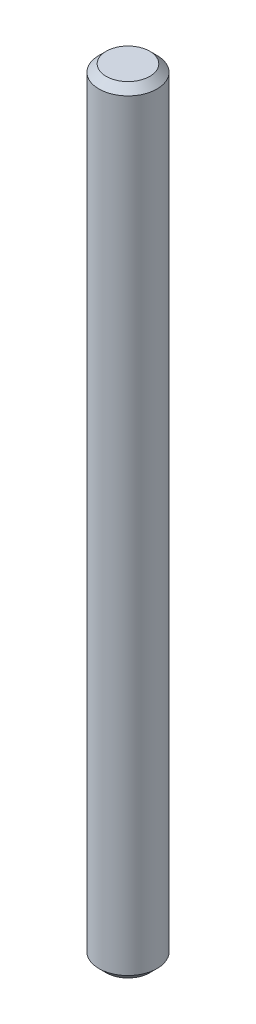
ISO-10303-21;
HEADER;
FILE_DESCRIPTION(('STEP AP214'),'2;1');
FILE_NAME('part.step','',(''),(''),'','','');
FILE_SCHEMA(('AUTOMOTIVE_DESIGN { 1 0 10303 214 1 1 1 1 }'));
ENDSEC;
DATA;
#1=APPLICATION_CONTEXT('core data for automotive mechanical design processes');
#2=APPLICATION_PROTOCOL_DEFINITION('international standard','automotive_design',2000,#1);
#3=PRODUCT_CONTEXT('',#1,'mechanical');
#4=PRODUCT('Part','Part','',(#3));
#5=PRODUCT_RELATED_PRODUCT_CATEGORY('part','',(#4));
#6=PRODUCT_DEFINITION_FORMATION('','',#4);
#7=PRODUCT_DEFINITION_CONTEXT('part definition',#1,'design');
#8=PRODUCT_DEFINITION('design','',#6,#7);
#9=PRODUCT_DEFINITION_SHAPE('','',#8);
#10=(LENGTH_UNIT() NAMED_UNIT(*) SI_UNIT(.MILLI.,.METRE.));
#11=(NAMED_UNIT(*) PLANE_ANGLE_UNIT() SI_UNIT($,.RADIAN.));
#12=(NAMED_UNIT(*) SI_UNIT($,.STERADIAN.) SOLID_ANGLE_UNIT());
#13=UNCERTAINTY_MEASURE_WITH_UNIT(LENGTH_MEASURE(1.E-05),#10,'distance_accuracy_value','');
#14=(GEOMETRIC_REPRESENTATION_CONTEXT(3) GLOBAL_UNCERTAINTY_ASSIGNED_CONTEXT((#13)) GLOBAL_UNIT_ASSIGNED_CONTEXT((#10,
#11,#12)) REPRESENTATION_CONTEXT('',''));
#15=CARTESIAN_POINT('',(0.,0.,0.));
#16=DIRECTION('',(0.,0.,1.));
#17=DIRECTION('',(1.,0.,0.));
#18=AXIS2_PLACEMENT_3D('',#15,#16,#17);
#19=CARTESIAN_POINT('',(0.,26.7,0.));
#20=DIRECTION('',(0.,-1.,0.));
#21=DIRECTION('',(0.,0.,-1.));
#22=AXIS2_PLACEMENT_3D('',#19,#20,#21);
#23=PLANE('',#22);
#24=CARTESIAN_POINT('',(0.,26.7,0.));
#25=DIRECTION('',(0.,1.,0.));
#26=DIRECTION('',(0.,0.,1.));
#27=AXIS2_PLACEMENT_3D('',#24,#25,#26);
#28=CIRCLE('',#27,1.5);
#29=CARTESIAN_POINT('',(0.,26.7,1.5));
#30=VERTEX_POINT('',#29);
#31=EDGE_CURVE('E10',#30,#30,#28,.T.);
#32=ORIENTED_EDGE('',*,*,#31,.T.);
#33=EDGE_LOOP('',(#32));
#34=FACE_BOUND('',#33,.T.);
#35=ADVANCED_FACE('F30',(#34),#23,.F.);
#36=CARTESIAN_POINT('',(0.,26.2,0.));
#37=DIRECTION('',(0.,-1.,0.));
#38=DIRECTION('',(0.,0.,-1.));
#39=AXIS2_PLACEMENT_3D('',#36,#37,#38);
#40=CONICAL_SURFACE('',#39,2.,0.785398163397448);
#41=ORIENTED_EDGE('',*,*,#31,.F.);
#42=EDGE_LOOP('',(#41));
#43=FACE_BOUND('',#42,.T.);
#44=CARTESIAN_POINT('',(0.,26.2,0.));
#45=DIRECTION('',(0.,1.,0.));
#46=DIRECTION('',(0.,0.,1.));
#47=AXIS2_PLACEMENT_3D('',#44,#45,#46);
#48=CIRCLE('',#47,2.);
#49=CARTESIAN_POINT('',(0.,26.2,2.));
#50=VERTEX_POINT('',#49);
#51=EDGE_CURVE('E36',#50,#50,#48,.T.);
#52=ORIENTED_EDGE('',*,*,#51,.T.);
#53=EDGE_LOOP('',(#52));
#54=FACE_BOUND('',#53,.T.);
#55=ADVANCED_FACE('F62',(#43,#54),#40,.T.);
#56=CARTESIAN_POINT('',(0.,-26.7,0.));
#57=DIRECTION('',(0.,1.,0.));
#58=DIRECTION('',(0.,0.,1.));
#59=AXIS2_PLACEMENT_3D('',#56,#57,#58);
#60=CYLINDRICAL_SURFACE('',#59,2.);
#61=ORIENTED_EDGE('',*,*,#51,.F.);
#62=EDGE_LOOP('',(#61));
#63=FACE_BOUND('',#62,.T.);
#64=CARTESIAN_POINT('',(0.,-26.2,0.));
#65=DIRECTION('',(0.,1.,0.));
#66=DIRECTION('',(0.,0.,1.));
#67=AXIS2_PLACEMENT_3D('',#64,#65,#66);
#68=CIRCLE('',#67,2.);
#69=CARTESIAN_POINT('',(0.,-26.2,2.));
#70=VERTEX_POINT('',#69);
#71=EDGE_CURVE('E40',#70,#70,#68,.T.);
#72=ORIENTED_EDGE('',*,*,#71,.T.);
#73=EDGE_LOOP('',(#72));
#74=FACE_BOUND('',#73,.T.);
#75=ADVANCED_FACE('F58',(#63,#74),#60,.T.);
#76=CARTESIAN_POINT('',(0.,-26.7,0.));
#77=DIRECTION('',(0.,1.,0.));
#78=DIRECTION('',(0.,0.,1.));
#79=AXIS2_PLACEMENT_3D('',#76,#77,#78);
#80=CONICAL_SURFACE('',#79,1.5,0.785398163397448);
#81=ORIENTED_EDGE('',*,*,#71,.F.);
#82=EDGE_LOOP('',(#81));
#83=FACE_BOUND('',#82,.T.);
#84=CARTESIAN_POINT('',(0.,-26.7,0.));
#85=DIRECTION('',(0.,1.,0.));
#86=DIRECTION('',(0.,0.,1.));
#87=AXIS2_PLACEMENT_3D('',#84,#85,#86);
#88=CIRCLE('',#87,1.5);
#89=CARTESIAN_POINT('',(0.,-26.7,1.5));
#90=VERTEX_POINT('',#89);
#91=EDGE_CURVE('E44',#90,#90,#88,.T.);
#92=ORIENTED_EDGE('',*,*,#91,.T.);
#93=EDGE_LOOP('',(#92));
#94=FACE_BOUND('',#93,.T.);
#95=ADVANCED_FACE('F50',(#83,#94),#80,.T.);
#96=CARTESIAN_POINT('',(1.5,-26.7,0.));
#97=DIRECTION('',(0.,1.,0.));
#98=DIRECTION('',(0.,0.,1.));
#99=AXIS2_PLACEMENT_3D('',#96,#97,#98);
#100=PLANE('',#99);
#101=ORIENTED_EDGE('',*,*,#91,.F.);
#102=EDGE_LOOP('',(#101));
#103=FACE_BOUND('',#102,.T.);
#104=ADVANCED_FACE('F52',(#103),#100,.F.);
#105=CLOSED_SHELL('',(#35,#55,#75,#95,#104));
#106=MANIFOLD_SOLID_BREP('B2',#105);
#107=ADVANCED_BREP_SHAPE_REPRESENTATION('',(#18,#106),#14);
#108=SHAPE_DEFINITION_REPRESENTATION(#9,#107);
ENDSEC;
END-ISO-10303-21;
